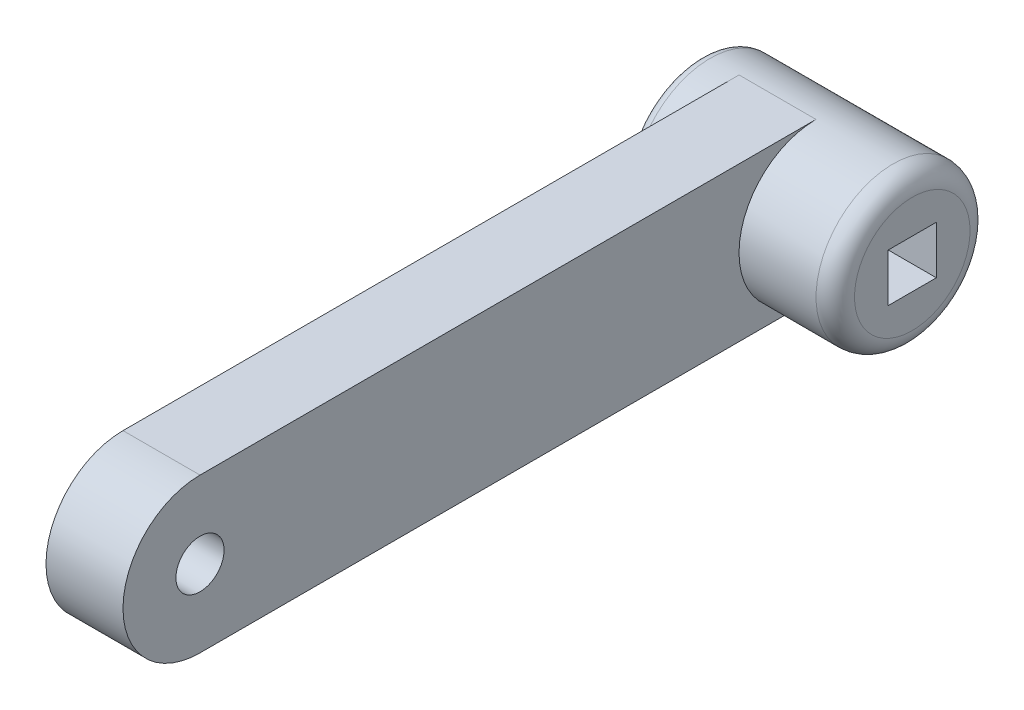
ISO-10303-21;
HEADER;
FILE_DESCRIPTION(('STEP AP214'),'2;1');
FILE_NAME('part.step','',(''),(''),'','','');
FILE_SCHEMA(('AUTOMOTIVE_DESIGN { 1 0 10303 214 1 1 1 1 }'));
ENDSEC;
DATA;
#1=APPLICATION_CONTEXT('core data for automotive mechanical design processes');
#2=APPLICATION_PROTOCOL_DEFINITION('international standard','automotive_design',2000,#1);
#3=PRODUCT_CONTEXT('',#1,'mechanical');
#4=PRODUCT('Part','Part','',(#3));
#5=PRODUCT_RELATED_PRODUCT_CATEGORY('part','',(#4));
#6=PRODUCT_DEFINITION_FORMATION('','',#4);
#7=PRODUCT_DEFINITION_CONTEXT('part definition',#1,'design');
#8=PRODUCT_DEFINITION('design','',#6,#7);
#9=PRODUCT_DEFINITION_SHAPE('','',#8);
#10=(LENGTH_UNIT() NAMED_UNIT(*) SI_UNIT(.MILLI.,.METRE.));
#11=(NAMED_UNIT(*) PLANE_ANGLE_UNIT() SI_UNIT($,.RADIAN.));
#12=(NAMED_UNIT(*) SI_UNIT($,.STERADIAN.) SOLID_ANGLE_UNIT());
#13=UNCERTAINTY_MEASURE_WITH_UNIT(LENGTH_MEASURE(1.E-05),#10,'distance_accuracy_value','');
#14=(GEOMETRIC_REPRESENTATION_CONTEXT(3) GLOBAL_UNCERTAINTY_ASSIGNED_CONTEXT((#13)) GLOBAL_UNIT_ASSIGNED_CONTEXT((#10,
#11,#12)) REPRESENTATION_CONTEXT('',''));
#15=CARTESIAN_POINT('',(0.,0.,0.));
#16=DIRECTION('',(0.,0.,1.));
#17=DIRECTION('',(1.,0.,0.));
#18=AXIS2_PLACEMENT_3D('',#15,#16,#17);
#19=CARTESIAN_POINT('',(10.16,0.,0.));
#20=DIRECTION('',(-1.,0.,0.));
#21=DIRECTION('',(0.,0.,1.));
#22=AXIS2_PLACEMENT_3D('',#19,#20,#21);
#23=CYLINDRICAL_SURFACE('',#22,10.16);
#24=CARTESIAN_POINT('',(15.24,0.,0.));
#25=DIRECTION('',(1.,0.,0.));
#26=DIRECTION('',(0.,0.,-1.));
#27=AXIS2_PLACEMENT_3D('',#24,#25,#26);
#28=CIRCLE('',#27,10.16);
#29=CARTESIAN_POINT('',(15.24,0.,-10.16));
#30=VERTEX_POINT('',#29);
#31=EDGE_CURVE('E11',#30,#30,#28,.F.);
#32=ORIENTED_EDGE('',*,*,#31,.T.);
#33=EDGE_LOOP('',(#32));
#34=FACE_BOUND('',#33,.T.);
#35=CARTESIAN_POINT('',(5.08,0.,0.));
#36=DIRECTION('',(1.,0.,0.));
#37=DIRECTION('',(0.,0.,-1.));
#38=AXIS2_PLACEMENT_3D('',#35,#36,#37);
#39=CIRCLE('',#38,10.16);
#40=CARTESIAN_POINT('',(5.08,10.16,0.));
#41=VERTEX_POINT('',#40);
#42=CARTESIAN_POINT('',(5.08,-10.16,0.));
#43=VERTEX_POINT('',#42);
#44=EDGE_CURVE('E57',#41,#43,#39,.T.);
#45=ORIENTED_EDGE('',*,*,#44,.T.);
#46=DIRECTION('',(-1.,0.,0.));
#47=VECTOR('',#46,1.);
#48=CARTESIAN_POINT('',(5.08,-10.16,0.));
#49=LINE('',#48,#47);
#50=CARTESIAN_POINT('',(-5.08,-10.16,0.));
#51=VERTEX_POINT('',#50);
#52=EDGE_CURVE('E160',#43,#51,#49,.T.);
#53=ORIENTED_EDGE('',*,*,#52,.T.);
#54=CARTESIAN_POINT('',(-5.08,0.,0.));
#55=DIRECTION('',(1.,0.,0.));
#56=DIRECTION('',(0.,0.,-1.));
#57=AXIS2_PLACEMENT_3D('',#54,#55,#56);
#58=CIRCLE('',#57,10.16);
#59=CARTESIAN_POINT('',(-5.08,10.16,0.));
#60=VERTEX_POINT('',#59);
#61=EDGE_CURVE('E171',#60,#51,#58,.T.);
#62=ORIENTED_EDGE('',*,*,#61,.F.);
#63=DIRECTION('',(-1.,0.,0.));
#64=VECTOR('',#63,1.);
#65=CARTESIAN_POINT('',(5.08,10.16,0.));
#66=LINE('',#65,#64);
#67=EDGE_CURVE('E157',#41,#60,#66,.T.);
#68=ORIENTED_EDGE('',*,*,#67,.F.);
#69=EDGE_LOOP('',(#45,#53,#62,#68));
#70=FACE_BOUND('',#69,.T.);
#71=CARTESIAN_POINT('',(-8.89,0.,0.));
#72=DIRECTION('',(1.,0.,0.));
#73=DIRECTION('',(0.,0.,-1.));
#74=AXIS2_PLACEMENT_3D('',#71,#72,#73);
#75=CIRCLE('',#74,10.16);
#76=CARTESIAN_POINT('',(-8.89,0.,-10.16));
#77=VERTEX_POINT('',#76);
#78=EDGE_CURVE('E165',#77,#77,#75,.T.);
#79=ORIENTED_EDGE('',*,*,#78,.T.);
#80=EDGE_LOOP('',(#79));
#81=FACE_BOUND('',#80,.T.);
#82=ADVANCED_FACE('F33',(#34,#70,#81),#23,.T.);
#83=CARTESIAN_POINT('',(-10.16,0.,0.));
#84=DIRECTION('',(1.,0.,0.));
#85=DIRECTION('',(0.,0.,-1.));
#86=AXIS2_PLACEMENT_3D('',#83,#84,#85);
#87=PLANE('',#86);
#88=CARTESIAN_POINT('',(-10.16,0.,0.));
#89=DIRECTION('',(1.,0.,0.));
#90=DIRECTION('',(0.,0.,-1.));
#91=AXIS2_PLACEMENT_3D('',#88,#89,#90);
#92=CIRCLE('',#91,8.89);
#93=CARTESIAN_POINT('',(-10.16,0.,-8.89));
#94=VERTEX_POINT('',#93);
#95=EDGE_CURVE('E168',#94,#94,#92,.F.);
#96=ORIENTED_EDGE('',*,*,#95,.T.);
#97=EDGE_LOOP('',(#96));
#98=FACE_BOUND('',#97,.T.);
#99=ADVANCED_FACE('F193',(#98),#87,.F.);
#100=CARTESIAN_POINT('',(-8.89,0.,0.));
#101=DIRECTION('',(1.,0.,0.));
#102=DIRECTION('',(0.,0.,-1.));
#103=AXIS2_PLACEMENT_3D('',#100,#101,#102);
#104=TOROIDAL_SURFACE('',#103,8.89,1.27);
#105=ORIENTED_EDGE('',*,*,#95,.F.);
#106=EDGE_LOOP('',(#105));
#107=FACE_BOUND('',#106,.T.);
#108=ORIENTED_EDGE('',*,*,#78,.F.);
#109=EDGE_LOOP('',(#108));
#110=FACE_BOUND('',#109,.T.);
#111=ADVANCED_FACE('F199',(#107,#110),#104,.T.);
#112=CARTESIAN_POINT('',(5.08,0.,81.28));
#113=DIRECTION('',(1.,0.,0.));
#114=DIRECTION('',(0.,0.,-1.));
#115=AXIS2_PLACEMENT_3D('',#112,#113,#114);
#116=PLANE('',#115);
#117=CARTESIAN_POINT('',(5.08,0.,81.28));
#118=DIRECTION('',(1.,0.,0.));
#119=DIRECTION('',(0.,0.,-1.));
#120=AXIS2_PLACEMENT_3D('',#117,#118,#119);
#121=CIRCLE('',#120,3.175);
#122=CARTESIAN_POINT('',(5.08,0.,78.105));
#123=VERTEX_POINT('',#122);
#124=EDGE_CURVE('E125',#123,#123,#121,.T.);
#125=ORIENTED_EDGE('',*,*,#124,.F.);
#126=EDGE_LOOP('',(#125));
#127=FACE_BOUND('',#126,.T.);
#128=ORIENTED_EDGE('',*,*,#44,.F.);
#129=DIRECTION('',(0.,0.,1.));
#130=VECTOR('',#129,1.);
#131=CARTESIAN_POINT('',(5.08,10.16,81.28));
#132=LINE('',#131,#130);
#133=CARTESIAN_POINT('',(5.08,10.16,81.28));
#134=VERTEX_POINT('',#133);
#135=EDGE_CURVE('E146',#41,#134,#132,.T.);
#136=ORIENTED_EDGE('',*,*,#135,.T.);
#137=CARTESIAN_POINT('',(5.08,0.,81.28));
#138=DIRECTION('',(1.,0.,0.));
#139=DIRECTION('',(0.,0.,-1.));
#140=AXIS2_PLACEMENT_3D('',#137,#138,#139);
#141=CIRCLE('',#140,10.16);
#142=CARTESIAN_POINT('',(5.08,-10.16,81.28));
#143=VERTEX_POINT('',#142);
#144=EDGE_CURVE('E140',#134,#143,#141,.T.);
#145=ORIENTED_EDGE('',*,*,#144,.T.);
#146=DIRECTION('',(0.,0.,-1.));
#147=VECTOR('',#146,1.);
#148=CARTESIAN_POINT('',(5.08,-10.16,81.28));
#149=LINE('',#148,#147);
#150=EDGE_CURVE('E143',#143,#43,#149,.T.);
#151=ORIENTED_EDGE('',*,*,#150,.T.);
#152=EDGE_LOOP('',(#128,#136,#145,#151));
#153=FACE_BOUND('',#152,.T.);
#154=ADVANCED_FACE('F204',(#127,#153),#116,.T.);
#155=CARTESIAN_POINT('',(-5.08,0.,81.28));
#156=DIRECTION('',(1.,0.,0.));
#157=DIRECTION('',(0.,0.,-1.));
#158=AXIS2_PLACEMENT_3D('',#155,#156,#157);
#159=PLANE('',#158);
#160=CARTESIAN_POINT('',(-5.08,0.,81.28));
#161=DIRECTION('',(1.,0.,0.));
#162=DIRECTION('',(0.,0.,-1.));
#163=AXIS2_PLACEMENT_3D('',#160,#161,#162);
#164=CIRCLE('',#163,3.175);
#165=CARTESIAN_POINT('',(-5.08,0.,78.105));
#166=VERTEX_POINT('',#165);
#167=EDGE_CURVE('E37',#166,#166,#164,.T.);
#168=ORIENTED_EDGE('',*,*,#167,.T.);
#169=EDGE_LOOP('',(#168));
#170=FACE_BOUND('',#169,.T.);
#171=DIRECTION('',(0.,0.,1.));
#172=VECTOR('',#171,1.);
#173=CARTESIAN_POINT('',(-5.08,10.16,81.28));
#174=LINE('',#173,#172);
#175=CARTESIAN_POINT('',(-5.08,10.16,81.28));
#176=VERTEX_POINT('',#175);
#177=EDGE_CURVE('E144',#60,#176,#174,.T.);
#178=ORIENTED_EDGE('',*,*,#177,.F.);
#179=ORIENTED_EDGE('',*,*,#61,.T.);
#180=DIRECTION('',(0.,0.,-1.));
#181=VECTOR('',#180,1.);
#182=CARTESIAN_POINT('',(-5.08,-10.16,81.28));
#183=LINE('',#182,#181);
#184=CARTESIAN_POINT('',(-5.08,-10.16,81.28));
#185=VERTEX_POINT('',#184);
#186=EDGE_CURVE('E151',#185,#51,#183,.T.);
#187=ORIENTED_EDGE('',*,*,#186,.F.);
#188=CARTESIAN_POINT('',(-5.08,0.,81.28));
#189=DIRECTION('',(1.,0.,0.));
#190=DIRECTION('',(0.,0.,-1.));
#191=AXIS2_PLACEMENT_3D('',#188,#189,#190);
#192=CIRCLE('',#191,10.16);
#193=EDGE_CURVE('E136',#176,#185,#192,.T.);
#194=ORIENTED_EDGE('',*,*,#193,.F.);
#195=EDGE_LOOP('',(#178,#179,#187,#194));
#196=FACE_BOUND('',#195,.T.);
#197=ADVANCED_FACE('F209',(#170,#196),#159,.F.);
#198=CARTESIAN_POINT('',(5.08,0.,81.28));
#199=DIRECTION('',(-1.,0.,0.));
#200=DIRECTION('',(0.,0.,1.));
#201=AXIS2_PLACEMENT_3D('',#198,#199,#200);
#202=CYLINDRICAL_SURFACE('',#201,10.16);
#203=ORIENTED_EDGE('',*,*,#193,.T.);
#204=DIRECTION('',(-1.,0.,0.));
#205=VECTOR('',#204,1.);
#206=CARTESIAN_POINT('',(5.08,-10.16,81.28));
#207=LINE('',#206,#205);
#208=EDGE_CURVE('E162',#143,#185,#207,.T.);
#209=ORIENTED_EDGE('',*,*,#208,.F.);
#210=ORIENTED_EDGE('',*,*,#144,.F.);
#211=DIRECTION('',(-1.,0.,0.));
#212=VECTOR('',#211,1.);
#213=CARTESIAN_POINT('',(5.08,10.16,81.28));
#214=LINE('',#213,#212);
#215=EDGE_CURVE('E148',#134,#176,#214,.T.);
#216=ORIENTED_EDGE('',*,*,#215,.T.);
#217=EDGE_LOOP('',(#203,#209,#210,#216));
#218=FACE_BOUND('',#217,.T.);
#219=ADVANCED_FACE('F219',(#218),#202,.T.);
#220=CARTESIAN_POINT('',(5.08,-10.16,81.28));
#221=DIRECTION('',(0.,1.,0.));
#222=DIRECTION('',(0.,0.,1.));
#223=AXIS2_PLACEMENT_3D('',#220,#221,#222);
#224=PLANE('',#223);
#225=ORIENTED_EDGE('',*,*,#186,.T.);
#226=ORIENTED_EDGE('',*,*,#52,.F.);
#227=ORIENTED_EDGE('',*,*,#150,.F.);
#228=ORIENTED_EDGE('',*,*,#208,.T.);
#229=EDGE_LOOP('',(#225,#226,#227,#228));
#230=FACE_BOUND('',#229,.T.);
#231=ADVANCED_FACE('F227',(#230),#224,.F.);
#232=CARTESIAN_POINT('',(5.08,10.16,81.28));
#233=DIRECTION('',(0.,-1.,0.));
#234=DIRECTION('',(0.,0.,-1.));
#235=AXIS2_PLACEMENT_3D('',#232,#233,#234);
#236=PLANE('',#235);
#237=ORIENTED_EDGE('',*,*,#177,.T.);
#238=ORIENTED_EDGE('',*,*,#215,.F.);
#239=ORIENTED_EDGE('',*,*,#135,.F.);
#240=ORIENTED_EDGE('',*,*,#67,.T.);
#241=EDGE_LOOP('',(#237,#238,#239,#240));
#242=FACE_BOUND('',#241,.T.);
#243=ADVANCED_FACE('F188',(#242),#236,.F.);
#244=CARTESIAN_POINT('',(17.78,0.,0.));
#245=DIRECTION('',(1.,0.,0.));
#246=DIRECTION('',(0.,0.,-1.));
#247=AXIS2_PLACEMENT_3D('',#244,#245,#246);
#248=PLANE('',#247);
#249=DIRECTION('',(0.,1.,0.));
#250=VECTOR('',#249,1.);
#251=CARTESIAN_POINT('',(17.78,3.175,-3.175));
#252=LINE('',#251,#250);
#253=CARTESIAN_POINT('',(17.78,-3.175,-3.175));
#254=VERTEX_POINT('',#253);
#255=CARTESIAN_POINT('',(17.78,3.175,-3.175));
#256=VERTEX_POINT('',#255);
#257=EDGE_CURVE('E49',#254,#256,#252,.T.);
#258=ORIENTED_EDGE('',*,*,#257,.F.);
#259=DIRECTION('',(0.,0.,-1.));
#260=VECTOR('',#259,1.);
#261=CARTESIAN_POINT('',(17.78,-3.175,3.175));
#262=LINE('',#261,#260);
#263=CARTESIAN_POINT('',(17.78,-3.175,3.175));
#264=VERTEX_POINT('',#263);
#265=EDGE_CURVE('E119',#264,#254,#262,.T.);
#266=ORIENTED_EDGE('',*,*,#265,.F.);
#267=DIRECTION('',(0.,-1.,0.));
#268=VECTOR('',#267,1.);
#269=CARTESIAN_POINT('',(17.78,3.175,3.175));
#270=LINE('',#269,#268);
#271=CARTESIAN_POINT('',(17.78,3.175,3.175));
#272=VERTEX_POINT('',#271);
#273=EDGE_CURVE('E122',#272,#264,#270,.T.);
#274=ORIENTED_EDGE('',*,*,#273,.F.);
#275=DIRECTION('',(0.,0.,1.));
#276=VECTOR('',#275,1.);
#277=CARTESIAN_POINT('',(17.78,3.175,3.175));
#278=LINE('',#277,#276);
#279=EDGE_CURVE('E130',#256,#272,#278,.T.);
#280=ORIENTED_EDGE('',*,*,#279,.F.);
#281=EDGE_LOOP('',(#258,#266,#274,#280));
#282=FACE_BOUND('',#281,.T.);
#283=CARTESIAN_POINT('',(17.78,0.,0.));
#284=DIRECTION('',(1.,0.,0.));
#285=DIRECTION('',(0.,0.,-1.));
#286=AXIS2_PLACEMENT_3D('',#283,#284,#285);
#287=CIRCLE('',#286,7.62);
#288=CARTESIAN_POINT('',(17.78,0.,-7.62));
#289=VERTEX_POINT('',#288);
#290=EDGE_CURVE('E42',#289,#289,#287,.T.);
#291=ORIENTED_EDGE('',*,*,#290,.T.);
#292=EDGE_LOOP('',(#291));
#293=FACE_BOUND('',#292,.T.);
#294=ADVANCED_FACE('F178',(#282,#293),#248,.T.);
#295=CARTESIAN_POINT('',(15.24,0.,0.));
#296=DIRECTION('',(1.,0.,0.));
#297=DIRECTION('',(0.,0.,-1.));
#298=AXIS2_PLACEMENT_3D('',#295,#296,#297);
#299=TOROIDAL_SURFACE('',#298,7.62,2.54);
#300=ORIENTED_EDGE('',*,*,#31,.F.);
#301=EDGE_LOOP('',(#300));
#302=FACE_BOUND('',#301,.T.);
#303=ORIENTED_EDGE('',*,*,#290,.F.);
#304=EDGE_LOOP('',(#303));
#305=FACE_BOUND('',#304,.T.);
#306=ADVANCED_FACE('F35',(#302,#305),#299,.T.);
#307=CARTESIAN_POINT('',(-7.62,3.175,-3.175));
#308=DIRECTION('',(0.,0.,-1.));
#309=DIRECTION('',(0.,1.,0.));
#310=AXIS2_PLACEMENT_3D('',#307,#308,#309);
#311=PLANE('',#310);
#312=ORIENTED_EDGE('',*,*,#257,.T.);
#313=DIRECTION('',(1.,0.,0.));
#314=VECTOR('',#313,1.);
#315=CARTESIAN_POINT('',(-7.62,3.175,-3.175));
#316=LINE('',#315,#314);
#317=CARTESIAN_POINT('',(-7.62,3.175,-3.175));
#318=VERTEX_POINT('',#317);
#319=EDGE_CURVE('E97',#318,#256,#316,.T.);
#320=ORIENTED_EDGE('',*,*,#319,.F.);
#321=DIRECTION('',(0.,1.,0.));
#322=VECTOR('',#321,1.);
#323=CARTESIAN_POINT('',(-7.62,3.175,-3.175));
#324=LINE('',#323,#322);
#325=CARTESIAN_POINT('',(-7.62,-3.175,-3.175));
#326=VERTEX_POINT('',#325);
#327=EDGE_CURVE('E101',#326,#318,#324,.T.);
#328=ORIENTED_EDGE('',*,*,#327,.F.);
#329=DIRECTION('',(1.,0.,0.));
#330=VECTOR('',#329,1.);
#331=CARTESIAN_POINT('',(-7.62,-3.175,-3.175));
#332=LINE('',#331,#330);
#333=EDGE_CURVE('E134',#326,#254,#332,.T.);
#334=ORIENTED_EDGE('',*,*,#333,.T.);
#335=EDGE_LOOP('',(#312,#320,#328,#334));
#336=FACE_BOUND('',#335,.T.);
#337=ADVANCED_FACE('F99',(#336),#311,.F.);
#338=CARTESIAN_POINT('',(-7.62,-3.175,3.175));
#339=DIRECTION('',(0.,-1.,0.));
#340=DIRECTION('',(0.,0.,-1.));
#341=AXIS2_PLACEMENT_3D('',#338,#339,#340);
#342=PLANE('',#341);
#343=ORIENTED_EDGE('',*,*,#265,.T.);
#344=ORIENTED_EDGE('',*,*,#333,.F.);
#345=DIRECTION('',(0.,0.,-1.));
#346=VECTOR('',#345,1.);
#347=CARTESIAN_POINT('',(-7.62,-3.175,3.175));
#348=LINE('',#347,#346);
#349=CARTESIAN_POINT('',(-7.62,-3.175,3.175));
#350=VERTEX_POINT('',#349);
#351=EDGE_CURVE('E107',#350,#326,#348,.T.);
#352=ORIENTED_EDGE('',*,*,#351,.F.);
#353=DIRECTION('',(1.,0.,0.));
#354=VECTOR('',#353,1.);
#355=CARTESIAN_POINT('',(-7.62,-3.175,3.175));
#356=LINE('',#355,#354);
#357=EDGE_CURVE('E137',#350,#264,#356,.T.);
#358=ORIENTED_EDGE('',*,*,#357,.T.);
#359=EDGE_LOOP('',(#343,#344,#352,#358));
#360=FACE_BOUND('',#359,.T.);
#361=ADVANCED_FACE('F186',(#360),#342,.F.);
#362=CARTESIAN_POINT('',(-7.62,3.175,3.175));
#363=DIRECTION('',(0.,0.,1.));
#364=DIRECTION('',(0.,-1.,0.));
#365=AXIS2_PLACEMENT_3D('',#362,#363,#364);
#366=PLANE('',#365);
#367=ORIENTED_EDGE('',*,*,#273,.T.);
#368=ORIENTED_EDGE('',*,*,#357,.F.);
#369=DIRECTION('',(0.,-1.,0.));
#370=VECTOR('',#369,1.);
#371=CARTESIAN_POINT('',(-7.62,3.175,3.175));
#372=LINE('',#371,#370);
#373=CARTESIAN_POINT('',(-7.62,3.175,3.175));
#374=VERTEX_POINT('',#373);
#375=EDGE_CURVE('E115',#374,#350,#372,.T.);
#376=ORIENTED_EDGE('',*,*,#375,.F.);
#377=DIRECTION('',(1.,0.,0.));
#378=VECTOR('',#377,1.);
#379=CARTESIAN_POINT('',(-7.62,3.175,3.175));
#380=LINE('',#379,#378);
#381=EDGE_CURVE('E106',#374,#272,#380,.T.);
#382=ORIENTED_EDGE('',*,*,#381,.T.);
#383=EDGE_LOOP('',(#367,#368,#376,#382));
#384=FACE_BOUND('',#383,.T.);
#385=ADVANCED_FACE('F275',(#384),#366,.F.);
#386=CARTESIAN_POINT('',(-7.62,3.175,3.175));
#387=DIRECTION('',(0.,1.,0.));
#388=DIRECTION('',(0.,0.,1.));
#389=AXIS2_PLACEMENT_3D('',#386,#387,#388);
#390=PLANE('',#389);
#391=ORIENTED_EDGE('',*,*,#279,.T.);
#392=ORIENTED_EDGE('',*,*,#381,.F.);
#393=DIRECTION('',(0.,0.,1.));
#394=VECTOR('',#393,1.);
#395=CARTESIAN_POINT('',(-7.62,3.175,3.175));
#396=LINE('',#395,#394);
#397=EDGE_CURVE('E110',#318,#374,#396,.T.);
#398=ORIENTED_EDGE('',*,*,#397,.F.);
#399=ORIENTED_EDGE('',*,*,#319,.T.);
#400=EDGE_LOOP('',(#391,#392,#398,#399));
#401=FACE_BOUND('',#400,.T.);
#402=ADVANCED_FACE('F111',(#401),#390,.F.);
#403=CARTESIAN_POINT('',(-7.62,0.,0.));
#404=DIRECTION('',(1.,0.,0.));
#405=DIRECTION('',(0.,0.,-1.));
#406=AXIS2_PLACEMENT_3D('',#403,#404,#405);
#407=PLANE('',#406);
#408=ORIENTED_EDGE('',*,*,#327,.T.);
#409=ORIENTED_EDGE('',*,*,#397,.T.);
#410=ORIENTED_EDGE('',*,*,#375,.T.);
#411=ORIENTED_EDGE('',*,*,#351,.T.);
#412=EDGE_LOOP('',(#408,#409,#410,#411));
#413=FACE_BOUND('',#412,.T.);
#414=ADVANCED_FACE('F117',(#413),#407,.T.);
#415=CARTESIAN_POINT('',(-10.16,0.,81.28));
#416=DIRECTION('',(1.,0.,0.));
#417=DIRECTION('',(0.,0.,-1.));
#418=AXIS2_PLACEMENT_3D('',#415,#416,#417);
#419=CYLINDRICAL_SURFACE('',#418,3.175);
#420=ORIENTED_EDGE('',*,*,#124,.T.);
#421=EDGE_LOOP('',(#420));
#422=FACE_BOUND('',#421,.T.);
#423=ORIENTED_EDGE('',*,*,#167,.F.);
#424=EDGE_LOOP('',(#423));
#425=FACE_BOUND('',#424,.T.);
#426=ADVANCED_FACE('F301',(#422,#425),#419,.F.);
#427=CLOSED_SHELL('',(#82,#99,#111,#154,#197,#219,#231,#243,#294,#306,#337,#361,#385,#402,#414,#426));
#428=MANIFOLD_SOLID_BREP('B2',#427);
#429=ADVANCED_BREP_SHAPE_REPRESENTATION('',(#18,#428),#14);
#430=SHAPE_DEFINITION_REPRESENTATION(#9,#429);
ENDSEC;
END-ISO-10303-21;
